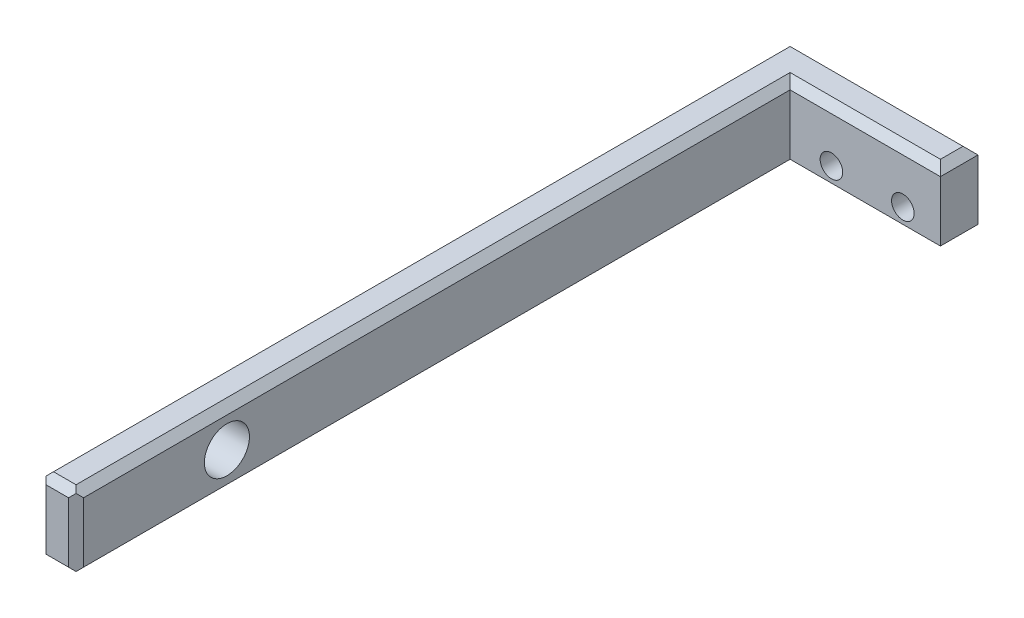
ISO-10303-21;
HEADER;
FILE_DESCRIPTION(('STEP AP214'),'2;1');
FILE_NAME('part.step','',(''),(''),'','','');
FILE_SCHEMA(('AUTOMOTIVE_DESIGN { 1 0 10303 214 1 1 1 1 }'));
ENDSEC;
DATA;
#1=APPLICATION_CONTEXT('core data for automotive mechanical design processes');
#2=APPLICATION_PROTOCOL_DEFINITION('international standard','automotive_design',2000,#1);
#3=PRODUCT_CONTEXT('',#1,'mechanical');
#4=PRODUCT('Part','Part','',(#3));
#5=PRODUCT_RELATED_PRODUCT_CATEGORY('part','',(#4));
#6=PRODUCT_DEFINITION_FORMATION('','',#4);
#7=PRODUCT_DEFINITION_CONTEXT('part definition',#1,'design');
#8=PRODUCT_DEFINITION('design','',#6,#7);
#9=PRODUCT_DEFINITION_SHAPE('','',#8);
#10=(LENGTH_UNIT() NAMED_UNIT(*) SI_UNIT(.MILLI.,.METRE.));
#11=(NAMED_UNIT(*) PLANE_ANGLE_UNIT() SI_UNIT($,.RADIAN.));
#12=(NAMED_UNIT(*) SI_UNIT($,.STERADIAN.) SOLID_ANGLE_UNIT());
#13=UNCERTAINTY_MEASURE_WITH_UNIT(LENGTH_MEASURE(1.E-05),#10,'distance_accuracy_value','');
#14=(GEOMETRIC_REPRESENTATION_CONTEXT(3) GLOBAL_UNCERTAINTY_ASSIGNED_CONTEXT((#13)) GLOBAL_UNIT_ASSIGNED_CONTEXT((#10,
#11,#12)) REPRESENTATION_CONTEXT('',''));
#15=CARTESIAN_POINT('',(0.,0.,0.));
#16=DIRECTION('',(0.,0.,1.));
#17=DIRECTION('',(1.,0.,0.));
#18=AXIS2_PLACEMENT_3D('',#15,#16,#17);
#19=CARTESIAN_POINT('',(5.,10.,0.));
#20=DIRECTION('',(0.,0.,-1.));
#21=DIRECTION('',(-1.,0.,0.));
#22=AXIS2_PLACEMENT_3D('',#19,#20,#21);
#23=PLANE('',#22);
#24=DIRECTION('',(-1.,0.,0.));
#25=VECTOR('',#24,1.);
#26=CARTESIAN_POINT('',(5.,9.,0.));
#27=LINE('',#26,#25);
#28=CARTESIAN_POINT('',(4.,9.,0.));
#29=VERTEX_POINT('',#28);
#30=CARTESIAN_POINT('',(1.,9.,0.));
#31=VERTEX_POINT('',#30);
#32=EDGE_CURVE('E210',#29,#31,#27,.T.);
#33=ORIENTED_EDGE('',*,*,#32,.T.);
#34=DIRECTION('',(0.,-1.,0.));
#35=VECTOR('',#34,1.);
#36=CARTESIAN_POINT('',(1.,10.,0.));
#37=LINE('',#36,#35);
#38=CARTESIAN_POINT('',(1.,1.,0.));
#39=VERTEX_POINT('',#38);
#40=EDGE_CURVE('E285',#31,#39,#37,.T.);
#41=ORIENTED_EDGE('',*,*,#40,.T.);
#42=DIRECTION('',(1.,0.,0.));
#43=VECTOR('',#42,1.);
#44=CARTESIAN_POINT('',(5.,1.,0.));
#45=LINE('',#44,#43);
#46=CARTESIAN_POINT('',(4.,1.,0.));
#47=VERTEX_POINT('',#46);
#48=EDGE_CURVE('E252',#39,#47,#45,.T.);
#49=ORIENTED_EDGE('',*,*,#48,.T.);
#50=DIRECTION('',(0.,1.,0.));
#51=VECTOR('',#50,1.);
#52=CARTESIAN_POINT('',(4.,10.,0.));
#53=LINE('',#52,#51);
#54=EDGE_CURVE('E283',#47,#29,#53,.T.);
#55=ORIENTED_EDGE('',*,*,#54,.T.);
#56=EDGE_LOOP('',(#33,#41,#49,#55));
#57=FACE_BOUND('',#56,.T.);
#58=ADVANCED_FACE('F43',(#57),#23,.F.);
#59=CARTESIAN_POINT('',(4.99999999999999,10.,-95.));
#60=DIRECTION('',(-1.,0.,0.));
#61=DIRECTION('',(0.,0.,1.));
#62=AXIS2_PLACEMENT_3D('',#59,#60,#61);
#63=PLANE('',#62);
#64=CARTESIAN_POINT('',(5.,5.,-20.0694910847058));
#65=DIRECTION('',(-1.,0.,0.));
#66=DIRECTION('',(0.,0.,1.));
#67=AXIS2_PLACEMENT_3D('',#64,#65,#66);
#68=CIRCLE('',#67,2.99999999999999);
#69=CARTESIAN_POINT('',(5.,5.,-17.0694910847058));
#70=VERTEX_POINT('',#69);
#71=EDGE_CURVE('E380',#70,#70,#68,.F.);
#72=ORIENTED_EDGE('',*,*,#71,.F.);
#73=EDGE_LOOP('',(#72));
#74=FACE_BOUND('',#73,.T.);
#75=DIRECTION('',(0.,0.,1.));
#76=VECTOR('',#75,1.);
#77=CARTESIAN_POINT('',(4.99999999999999,9.,-95.));
#78=LINE('',#77,#76);
#79=CARTESIAN_POINT('',(4.99999999999999,9.,-95.));
#80=VERTEX_POINT('',#79);
#81=CARTESIAN_POINT('',(5.,9.,-1.));
#82=VERTEX_POINT('',#81);
#83=EDGE_CURVE('E208',#80,#82,#78,.T.);
#84=ORIENTED_EDGE('',*,*,#83,.T.);
#85=DIRECTION('',(0.,-1.,0.));
#86=VECTOR('',#85,1.);
#87=CARTESIAN_POINT('',(5.,10.,-1.));
#88=LINE('',#87,#86);
#89=CARTESIAN_POINT('',(5.,1.,-1.));
#90=VERTEX_POINT('',#89);
#91=EDGE_CURVE('E301',#82,#90,#88,.T.);
#92=ORIENTED_EDGE('',*,*,#91,.T.);
#93=DIRECTION('',(0.,0.,-1.));
#94=VECTOR('',#93,1.);
#95=CARTESIAN_POINT('',(4.99999999999999,1.,-95.));
#96=LINE('',#95,#94);
#97=CARTESIAN_POINT('',(4.99999999999999,1.,-95.));
#98=VERTEX_POINT('',#97);
#99=EDGE_CURVE('E212',#90,#98,#96,.T.);
#100=ORIENTED_EDGE('',*,*,#99,.T.);
#101=DIRECTION('',(0.,-1.,0.));
#102=VECTOR('',#101,1.);
#103=CARTESIAN_POINT('',(4.99999999999999,10.,-95.));
#104=LINE('',#103,#102);
#105=EDGE_CURVE('E189',#80,#98,#104,.T.);
#106=ORIENTED_EDGE('',*,*,#105,.F.);
#107=EDGE_LOOP('',(#84,#92,#100,#106));
#108=FACE_BOUND('',#107,.T.);
#109=ADVANCED_FACE('F374',(#74,#108),#63,.F.);
#110=CARTESIAN_POINT('',(25.,10.,-95.));
#111=DIRECTION('',(0.,0.,-1.));
#112=DIRECTION('',(-1.,0.,0.));
#113=AXIS2_PLACEMENT_3D('',#110,#111,#112);
#114=PLANE('',#113);
#115=CARTESIAN_POINT('',(20.,3.,-95.));
#116=DIRECTION('',(0.,0.,-1.));
#117=DIRECTION('',(-1.,0.,0.));
#118=AXIS2_PLACEMENT_3D('',#115,#116,#117);
#119=CIRCLE('',#118,1.5);
#120=CARTESIAN_POINT('',(18.5,3.,-95.));
#121=VERTEX_POINT('',#120);
#122=EDGE_CURVE('E386',#121,#121,#119,.T.);
#123=ORIENTED_EDGE('',*,*,#122,.T.);
#124=EDGE_LOOP('',(#123));
#125=FACE_BOUND('',#124,.T.);
#126=CARTESIAN_POINT('',(10.5,3.,-95.));
#127=DIRECTION('',(0.,0.,-1.));
#128=DIRECTION('',(-1.,0.,0.));
#129=AXIS2_PLACEMENT_3D('',#126,#127,#128);
#130=CIRCLE('',#129,1.5);
#131=CARTESIAN_POINT('',(9.,3.,-95.));
#132=VERTEX_POINT('',#131);
#133=EDGE_CURVE('E389',#132,#132,#130,.T.);
#134=ORIENTED_EDGE('',*,*,#133,.T.);
#135=EDGE_LOOP('',(#134));
#136=FACE_BOUND('',#135,.T.);
#137=ORIENTED_EDGE('',*,*,#105,.T.);
#138=DIRECTION('',(1.,0.,0.));
#139=VECTOR('',#138,1.);
#140=CARTESIAN_POINT('',(25.,1.,-95.));
#141=LINE('',#140,#139);
#142=CARTESIAN_POINT('',(25.,1.,-95.));
#143=VERTEX_POINT('',#142);
#144=EDGE_CURVE('E242',#98,#143,#141,.T.);
#145=ORIENTED_EDGE('',*,*,#144,.T.);
#146=DIRECTION('',(0.,-1.,0.));
#147=VECTOR('',#146,1.);
#148=CARTESIAN_POINT('',(25.,10.,-95.));
#149=LINE('',#148,#147);
#150=CARTESIAN_POINT('',(25.,9.,-95.));
#151=VERTEX_POINT('',#150);
#152=EDGE_CURVE('E357',#151,#143,#149,.T.);
#153=ORIENTED_EDGE('',*,*,#152,.F.);
#154=DIRECTION('',(-1.,0.,0.));
#155=VECTOR('',#154,1.);
#156=CARTESIAN_POINT('',(25.,9.,-95.));
#157=LINE('',#156,#155);
#158=EDGE_CURVE('E206',#151,#80,#157,.T.);
#159=ORIENTED_EDGE('',*,*,#158,.T.);
#160=EDGE_LOOP('',(#137,#145,#153,#159));
#161=FACE_BOUND('',#160,.T.);
#162=ADVANCED_FACE('F363',(#125,#136,#161),#114,.F.);
#163=CARTESIAN_POINT('',(25.,10.,-100.));
#164=DIRECTION('',(-1.,0.,0.));
#165=DIRECTION('',(0.,0.,1.));
#166=AXIS2_PLACEMENT_3D('',#163,#164,#165);
#167=PLANE('',#166);
#168=ORIENTED_EDGE('',*,*,#152,.T.);
#169=DIRECTION('',(0.,0.,-1.));
#170=VECTOR('',#169,1.);
#171=CARTESIAN_POINT('',(25.,1.,-100.));
#172=LINE('',#171,#170);
#173=CARTESIAN_POINT('',(25.,1.,-100.));
#174=VERTEX_POINT('',#173);
#175=EDGE_CURVE('E244',#143,#174,#172,.T.);
#176=ORIENTED_EDGE('',*,*,#175,.T.);
#177=DIRECTION('',(0.,-1.,0.));
#178=VECTOR('',#177,1.);
#179=CARTESIAN_POINT('',(25.,10.,-100.));
#180=LINE('',#179,#178);
#181=CARTESIAN_POINT('',(25.,9.,-100.));
#182=VERTEX_POINT('',#181);
#183=EDGE_CURVE('E359',#182,#174,#180,.T.);
#184=ORIENTED_EDGE('',*,*,#183,.F.);
#185=DIRECTION('',(0.,0.,1.));
#186=VECTOR('',#185,1.);
#187=CARTESIAN_POINT('',(25.,9.,-100.));
#188=LINE('',#187,#186);
#189=EDGE_CURVE('E204',#182,#151,#188,.T.);
#190=ORIENTED_EDGE('',*,*,#189,.T.);
#191=EDGE_LOOP('',(#168,#176,#184,#190));
#192=FACE_BOUND('',#191,.T.);
#193=ADVANCED_FACE('F356',(#192),#167,.F.);
#194=CARTESIAN_POINT('',(0.,10.,-100.));
#195=DIRECTION('',(0.,0.,1.));
#196=DIRECTION('',(1.,0.,0.));
#197=AXIS2_PLACEMENT_3D('',#194,#195,#196);
#198=PLANE('',#197);
#199=CARTESIAN_POINT('',(20.,3.,-100.));
#200=DIRECTION('',(0.,0.,-1.));
#201=DIRECTION('',(-1.,0.,0.));
#202=AXIS2_PLACEMENT_3D('',#199,#200,#201);
#203=CIRCLE('',#202,1.5);
#204=CARTESIAN_POINT('',(18.5,3.,-100.));
#205=VERTEX_POINT('',#204);
#206=EDGE_CURVE('E392',#205,#205,#203,.T.);
#207=ORIENTED_EDGE('',*,*,#206,.F.);
#208=EDGE_LOOP('',(#207));
#209=FACE_BOUND('',#208,.T.);
#210=CARTESIAN_POINT('',(10.5,3.,-100.));
#211=DIRECTION('',(0.,0.,-1.));
#212=DIRECTION('',(-1.,0.,0.));
#213=AXIS2_PLACEMENT_3D('',#210,#211,#212);
#214=CIRCLE('',#213,1.5);
#215=CARTESIAN_POINT('',(9.,3.,-100.));
#216=VERTEX_POINT('',#215);
#217=EDGE_CURVE('E225',#216,#216,#214,.T.);
#218=ORIENTED_EDGE('',*,*,#217,.F.);
#219=EDGE_LOOP('',(#218));
#220=FACE_BOUND('',#219,.T.);
#221=DIRECTION('',(-1.,0.,0.));
#222=VECTOR('',#221,1.);
#223=CARTESIAN_POINT('',(0.,1.,-100.));
#224=LINE('',#223,#222);
#225=CARTESIAN_POINT('',(1.00000000000001,1.,-100.));
#226=VERTEX_POINT('',#225);
#227=EDGE_CURVE('E246',#174,#226,#224,.T.);
#228=ORIENTED_EDGE('',*,*,#227,.T.);
#229=DIRECTION('',(0.,1.,0.));
#230=VECTOR('',#229,1.);
#231=CARTESIAN_POINT('',(1.00000000000001,10.,-100.));
#232=LINE('',#231,#230);
#233=CARTESIAN_POINT('',(1.00000000000001,9.,-100.));
#234=VERTEX_POINT('',#233);
#235=EDGE_CURVE('E276',#226,#234,#232,.T.);
#236=ORIENTED_EDGE('',*,*,#235,.T.);
#237=DIRECTION('',(1.,0.,0.));
#238=VECTOR('',#237,1.);
#239=CARTESIAN_POINT('',(0.,9.,-100.));
#240=LINE('',#239,#238);
#241=EDGE_CURVE('E197',#234,#182,#240,.T.);
#242=ORIENTED_EDGE('',*,*,#241,.T.);
#243=ORIENTED_EDGE('',*,*,#183,.T.);
#244=EDGE_LOOP('',(#228,#236,#242,#243));
#245=FACE_BOUND('',#244,.T.);
#246=ADVANCED_FACE('F342',(#209,#220,#245),#198,.F.);
#247=CARTESIAN_POINT('',(0.,10.,0.));
#248=DIRECTION('',(1.,0.,0.));
#249=DIRECTION('',(0.,0.,-1.));
#250=AXIS2_PLACEMENT_3D('',#247,#248,#249);
#251=PLANE('',#250);
#252=CARTESIAN_POINT('',(0.,5.,-20.0694910847058));
#253=DIRECTION('',(1.,0.,0.));
#254=DIRECTION('',(0.,0.,-1.));
#255=AXIS2_PLACEMENT_3D('',#252,#253,#254);
#256=CIRCLE('',#255,2.99999999999999);
#257=CARTESIAN_POINT('',(0.,5.,-23.0694910847058));
#258=VERTEX_POINT('',#257);
#259=EDGE_CURVE('E383',#258,#258,#256,.T.);
#260=ORIENTED_EDGE('',*,*,#259,.T.);
#261=EDGE_LOOP('',(#260));
#262=FACE_BOUND('',#261,.T.);
#263=DIRECTION('',(0.,0.,1.));
#264=VECTOR('',#263,1.);
#265=CARTESIAN_POINT('',(0.,1.,0.));
#266=LINE('',#265,#264);
#267=CARTESIAN_POINT('',(0.,1.,-99.));
#268=VERTEX_POINT('',#267);
#269=CARTESIAN_POINT('',(0.,1.,-1.));
#270=VERTEX_POINT('',#269);
#271=EDGE_CURVE('E249',#268,#270,#266,.T.);
#272=ORIENTED_EDGE('',*,*,#271,.T.);
#273=DIRECTION('',(0.,1.,0.));
#274=VECTOR('',#273,1.);
#275=CARTESIAN_POINT('',(0.,10.,-1.));
#276=LINE('',#275,#274);
#277=CARTESIAN_POINT('',(0.,9.,-1.));
#278=VERTEX_POINT('',#277);
#279=EDGE_CURVE('E294',#270,#278,#276,.T.);
#280=ORIENTED_EDGE('',*,*,#279,.T.);
#281=DIRECTION('',(0.,0.,-1.));
#282=VECTOR('',#281,1.);
#283=CARTESIAN_POINT('',(0.,9.,0.));
#284=LINE('',#283,#282);
#285=CARTESIAN_POINT('',(0.,9.,-99.));
#286=VERTEX_POINT('',#285);
#287=EDGE_CURVE('E195',#278,#286,#284,.T.);
#288=ORIENTED_EDGE('',*,*,#287,.T.);
#289=DIRECTION('',(0.,-1.,0.));
#290=VECTOR('',#289,1.);
#291=CARTESIAN_POINT('',(0.,10.,-99.));
#292=LINE('',#291,#290);
#293=EDGE_CURVE('E255',#286,#268,#292,.T.);
#294=ORIENTED_EDGE('',*,*,#293,.T.);
#295=EDGE_LOOP('',(#272,#280,#288,#294));
#296=FACE_BOUND('',#295,.T.);
#297=ADVANCED_FACE('F326',(#262,#296),#251,.F.);
#298=CARTESIAN_POINT('',(0.,10.,0.));
#299=DIRECTION('',(0.,-1.,0.));
#300=DIRECTION('',(0.,0.,-1.));
#301=AXIS2_PLACEMENT_3D('',#298,#299,#300);
#302=PLANE('',#301);
#303=DIRECTION('',(-1.,0.,0.));
#304=VECTOR('',#303,1.);
#305=CARTESIAN_POINT('',(0.,10.,-99.));
#306=LINE('',#305,#304);
#307=CARTESIAN_POINT('',(24.,10.,-99.));
#308=VERTEX_POINT('',#307);
#309=CARTESIAN_POINT('',(1.,10.,-99.));
#310=VERTEX_POINT('',#309);
#311=EDGE_CURVE('E193',#308,#310,#306,.T.);
#312=ORIENTED_EDGE('',*,*,#311,.T.);
#313=DIRECTION('',(0.,0.,1.));
#314=VECTOR('',#313,1.);
#315=CARTESIAN_POINT('',(1.,10.,0.));
#316=LINE('',#315,#314);
#317=CARTESIAN_POINT('',(1.,10.,-1.));
#318=VERTEX_POINT('',#317);
#319=EDGE_CURVE('E174',#310,#318,#316,.T.);
#320=ORIENTED_EDGE('',*,*,#319,.T.);
#321=DIRECTION('',(1.,0.,0.));
#322=VECTOR('',#321,1.);
#323=CARTESIAN_POINT('',(0.,10.,-1.));
#324=LINE('',#323,#322);
#325=CARTESIAN_POINT('',(4.,10.,-1.));
#326=VERTEX_POINT('',#325);
#327=EDGE_CURVE('E183',#318,#326,#324,.T.);
#328=ORIENTED_EDGE('',*,*,#327,.T.);
#329=DIRECTION('',(0.,0.,-1.));
#330=VECTOR('',#329,1.);
#331=CARTESIAN_POINT('',(4.,10.,0.));
#332=LINE('',#331,#330);
#333=CARTESIAN_POINT('',(3.99999999999999,10.,-96.));
#334=VERTEX_POINT('',#333);
#335=EDGE_CURVE('E188',#326,#334,#332,.T.);
#336=ORIENTED_EDGE('',*,*,#335,.T.);
#337=DIRECTION('',(1.,0.,0.));
#338=VECTOR('',#337,1.);
#339=CARTESIAN_POINT('',(0.,10.,-96.));
#340=LINE('',#339,#338);
#341=CARTESIAN_POINT('',(24.,10.,-96.));
#342=VERTEX_POINT('',#341);
#343=EDGE_CURVE('E371',#334,#342,#340,.T.);
#344=ORIENTED_EDGE('',*,*,#343,.T.);
#345=DIRECTION('',(0.,0.,-1.));
#346=VECTOR('',#345,1.);
#347=CARTESIAN_POINT('',(24.,10.,0.));
#348=LINE('',#347,#346);
#349=EDGE_CURVE('E199',#342,#308,#348,.T.);
#350=ORIENTED_EDGE('',*,*,#349,.T.);
#351=EDGE_LOOP('',(#312,#320,#328,#336,#344,#350));
#352=FACE_BOUND('',#351,.T.);
#353=ADVANCED_FACE('F191',(#352),#302,.F.);
#354=CARTESIAN_POINT('',(0.,0.,0.));
#355=DIRECTION('',(0.,-1.,0.));
#356=DIRECTION('',(0.,0.,-1.));
#357=AXIS2_PLACEMENT_3D('',#354,#355,#356);
#358=PLANE('',#357);
#359=DIRECTION('',(-1.,0.,0.));
#360=VECTOR('',#359,1.);
#361=CARTESIAN_POINT('',(4.99999999999999,0.,-96.));
#362=LINE('',#361,#360);
#363=CARTESIAN_POINT('',(24.,0.,-96.));
#364=VERTEX_POINT('',#363);
#365=CARTESIAN_POINT('',(3.99999999999999,0.,-96.));
#366=VERTEX_POINT('',#365);
#367=EDGE_CURVE('E237',#364,#366,#362,.T.);
#368=ORIENTED_EDGE('',*,*,#367,.T.);
#369=DIRECTION('',(0.,0.,1.));
#370=VECTOR('',#369,1.);
#371=CARTESIAN_POINT('',(4.,0.,0.));
#372=LINE('',#371,#370);
#373=CARTESIAN_POINT('',(4.,0.,-1.));
#374=VERTEX_POINT('',#373);
#375=EDGE_CURVE('E239',#366,#374,#372,.T.);
#376=ORIENTED_EDGE('',*,*,#375,.T.);
#377=DIRECTION('',(-1.,0.,0.));
#378=VECTOR('',#377,1.);
#379=CARTESIAN_POINT('',(0.,0.,-1.));
#380=LINE('',#379,#378);
#381=CARTESIAN_POINT('',(1.,0.,-1.));
#382=VERTEX_POINT('',#381);
#383=EDGE_CURVE('E227',#374,#382,#380,.T.);
#384=ORIENTED_EDGE('',*,*,#383,.T.);
#385=DIRECTION('',(0.,0.,-1.));
#386=VECTOR('',#385,1.);
#387=CARTESIAN_POINT('',(1.,0.,-100.));
#388=LINE('',#387,#386);
#389=CARTESIAN_POINT('',(1.,0.,-99.));
#390=VERTEX_POINT('',#389);
#391=EDGE_CURVE('E230',#382,#390,#388,.T.);
#392=ORIENTED_EDGE('',*,*,#391,.T.);
#393=DIRECTION('',(1.,0.,0.));
#394=VECTOR('',#393,1.);
#395=CARTESIAN_POINT('',(25.,0.,-99.));
#396=LINE('',#395,#394);
#397=CARTESIAN_POINT('',(24.,0.,-99.));
#398=VERTEX_POINT('',#397);
#399=EDGE_CURVE('E233',#390,#398,#396,.T.);
#400=ORIENTED_EDGE('',*,*,#399,.T.);
#401=DIRECTION('',(0.,0.,1.));
#402=VECTOR('',#401,1.);
#403=CARTESIAN_POINT('',(24.,0.,-95.));
#404=LINE('',#403,#402);
#405=EDGE_CURVE('E235',#398,#364,#404,.T.);
#406=ORIENTED_EDGE('',*,*,#405,.T.);
#407=EDGE_LOOP('',(#368,#376,#384,#392,#400,#406));
#408=FACE_BOUND('',#407,.T.);
#409=ADVANCED_FACE('F568',(#408),#358,.T.);
#410=CARTESIAN_POINT('',(10.,5.,-20.0694910847058));
#411=DIRECTION('',(-1.,0.,0.));
#412=DIRECTION('',(0.,0.,1.));
#413=AXIS2_PLACEMENT_3D('',#410,#411,#412);
#414=CYLINDRICAL_SURFACE('',#413,2.99999999999999);
#415=ORIENTED_EDGE('',*,*,#259,.F.);
#416=EDGE_LOOP('',(#415));
#417=FACE_BOUND('',#416,.T.);
#418=ORIENTED_EDGE('',*,*,#71,.T.);
#419=EDGE_LOOP('',(#418));
#420=FACE_BOUND('',#419,.T.);
#421=ADVANCED_FACE('F409',(#417,#420),#414,.F.);
#422=CARTESIAN_POINT('',(10.5,3.,-80.));
#423=DIRECTION('',(0.,0.,-1.));
#424=DIRECTION('',(-1.,0.,0.));
#425=AXIS2_PLACEMENT_3D('',#422,#423,#424);
#426=CYLINDRICAL_SURFACE('',#425,1.5);
#427=ORIENTED_EDGE('',*,*,#217,.T.);
#428=EDGE_LOOP('',(#427));
#429=FACE_BOUND('',#428,.T.);
#430=ORIENTED_EDGE('',*,*,#133,.F.);
#431=EDGE_LOOP('',(#430));
#432=FACE_BOUND('',#431,.T.);
#433=ADVANCED_FACE('F406',(#429,#432),#426,.F.);
#434=CARTESIAN_POINT('',(20.,3.,-80.));
#435=DIRECTION('',(0.,0.,-1.));
#436=DIRECTION('',(-1.,0.,0.));
#437=AXIS2_PLACEMENT_3D('',#434,#435,#436);
#438=CYLINDRICAL_SURFACE('',#437,1.5);
#439=ORIENTED_EDGE('',*,*,#206,.T.);
#440=EDGE_LOOP('',(#439));
#441=FACE_BOUND('',#440,.T.);
#442=ORIENTED_EDGE('',*,*,#122,.F.);
#443=EDGE_LOOP('',(#442));
#444=FACE_BOUND('',#443,.T.);
#445=ADVANCED_FACE('F398',(#441,#444),#438,.F.);
#446=CARTESIAN_POINT('',(0.,10.,-96.));
#447=DIRECTION('',(0.,-0.707106781186547,-0.707106781186547));
#448=DIRECTION('',(1.,0.,0.));
#449=AXIS2_PLACEMENT_3D('',#446,#447,#448);
#450=PLANE('',#449);
#451=DIRECTION('',(-0.577350269189626,0.577350269189626,-0.577350269189626));
#452=VECTOR('',#451,1.);
#453=CARTESIAN_POINT('',(2.66666666666666,11.3333333333333,-97.3333333333333));
#454=LINE('',#453,#452);
#455=EDGE_CURVE('E219',#80,#334,#454,.T.);
#456=ORIENTED_EDGE('',*,*,#455,.F.);
#457=ORIENTED_EDGE('',*,*,#158,.F.);
#458=DIRECTION('',(-0.577350269189626,0.577350269189626,-0.577350269189626));
#459=VECTOR('',#458,1.);
#460=CARTESIAN_POINT('',(16.,18.,-104.));
#461=LINE('',#460,#459);
#462=EDGE_CURVE('E222',#342,#151,#461,.F.);
#463=ORIENTED_EDGE('',*,*,#462,.F.);
#464=ORIENTED_EDGE('',*,*,#343,.F.);
#465=EDGE_LOOP('',(#456,#457,#463,#464));
#466=FACE_BOUND('',#465,.T.);
#467=ADVANCED_FACE('F369',(#466),#450,.F.);
#468=CARTESIAN_POINT('',(24.,10.,0.));
#469=DIRECTION('',(-0.707106781186547,-0.707106781186547,0.));
#470=DIRECTION('',(0.,0.,-1.));
#471=AXIS2_PLACEMENT_3D('',#468,#469,#470);
#472=PLANE('',#471);
#473=ORIENTED_EDGE('',*,*,#462,.T.);
#474=ORIENTED_EDGE('',*,*,#189,.F.);
#475=DIRECTION('',(-0.577350269189626,0.577350269189626,0.577350269189626));
#476=VECTOR('',#475,1.);
#477=CARTESIAN_POINT('',(-9.00000000000001,43.,-66.));
#478=LINE('',#477,#476);
#479=EDGE_CURVE('E216',#308,#182,#478,.F.);
#480=ORIENTED_EDGE('',*,*,#479,.F.);
#481=ORIENTED_EDGE('',*,*,#349,.F.);
#482=EDGE_LOOP('',(#473,#474,#480,#481));
#483=FACE_BOUND('',#482,.T.);
#484=ADVANCED_FACE('F351',(#483),#472,.F.);
#485=CARTESIAN_POINT('',(4.,10.,0.));
#486=DIRECTION('',(-0.707106781186547,-0.707106781186547,0.));
#487=DIRECTION('',(0.,0.,-1.));
#488=AXIS2_PLACEMENT_3D('',#485,#486,#487);
#489=PLANE('',#488);
#490=DIRECTION('',(-0.577350269189626,0.577350269189626,-0.577350269189626));
#491=VECTOR('',#490,1.);
#492=CARTESIAN_POINT('',(2.66666666666667,11.3333333333333,-2.33333333333333));
#493=LINE('',#492,#491);
#494=CARTESIAN_POINT('',(4.5,9.5,-0.500000000000001));
#495=VERTEX_POINT('',#494);
#496=EDGE_CURVE('E185',#495,#326,#493,.T.);
#497=ORIENTED_EDGE('',*,*,#496,.F.);
#498=DIRECTION('',(0.577350269189626,-0.577350269189626,-0.577350269189626));
#499=VECTOR('',#498,1.);
#500=CARTESIAN_POINT('',(4.,10.,0.));
#501=LINE('',#500,#499);
#502=EDGE_CURVE('E11',#495,#82,#501,.T.);
#503=ORIENTED_EDGE('',*,*,#502,.T.);
#504=ORIENTED_EDGE('',*,*,#83,.F.);
#505=ORIENTED_EDGE('',*,*,#455,.T.);
#506=ORIENTED_EDGE('',*,*,#335,.F.);
#507=EDGE_LOOP('',(#497,#503,#504,#505,#506));
#508=FACE_BOUND('',#507,.T.);
#509=ADVANCED_FACE('F372',(#508),#489,.F.);
#510=CARTESIAN_POINT('',(0.,10.,-99.));
#511=DIRECTION('',(0.,-0.707106781186547,0.707106781186547));
#512=DIRECTION('',(-1.,0.,0.));
#513=AXIS2_PLACEMENT_3D('',#510,#511,#512);
#514=PLANE('',#513);
#515=ORIENTED_EDGE('',*,*,#241,.F.);
#516=DIRECTION('',(-0.57735026918962,0.577350269189628,0.577350269189628));
#517=VECTOR('',#516,1.);
#518=CARTESIAN_POINT('',(0.,10.,-99.));
#519=LINE('',#518,#517);
#520=CARTESIAN_POINT('',(0.500000000000015,9.50000000000002,-99.5));
#521=VERTEX_POINT('',#520);
#522=EDGE_CURVE('E278',#234,#521,#519,.T.);
#523=ORIENTED_EDGE('',*,*,#522,.T.);
#524=DIRECTION('',(0.577350269189626,0.577350269189626,0.577350269189626));
#525=VECTOR('',#524,1.);
#526=CARTESIAN_POINT('',(0.666666666666667,9.66666666666667,-99.3333333333333));
#527=LINE('',#526,#525);
#528=EDGE_CURVE('E179',#310,#521,#527,.F.);
#529=ORIENTED_EDGE('',*,*,#528,.F.);
#530=ORIENTED_EDGE('',*,*,#311,.F.);
#531=ORIENTED_EDGE('',*,*,#479,.T.);
#532=EDGE_LOOP('',(#515,#523,#529,#530,#531));
#533=FACE_BOUND('',#532,.T.);
#534=ADVANCED_FACE('F346',(#533),#514,.F.);
#535=CARTESIAN_POINT('',(0.,10.,-1.));
#536=DIRECTION('',(0.,-0.707106781186547,-0.707106781186547));
#537=DIRECTION('',(1.,0.,0.));
#538=AXIS2_PLACEMENT_3D('',#535,#536,#537);
#539=PLANE('',#538);
#540=DIRECTION('',(-0.577350269189626,-0.577350269189626,0.577350269189626));
#541=VECTOR('',#540,1.);
#542=CARTESIAN_POINT('',(0.666666666666667,9.66666666666667,-0.666666666666667));
#543=LINE('',#542,#541);
#544=CARTESIAN_POINT('',(0.5,9.5,-0.5));
#545=VERTEX_POINT('',#544);
#546=EDGE_CURVE('E168',#545,#318,#543,.F.);
#547=ORIENTED_EDGE('',*,*,#546,.F.);
#548=DIRECTION('',(0.577350269189626,-0.577350269189626,0.577350269189626));
#549=VECTOR('',#548,1.);
#550=CARTESIAN_POINT('',(0.,10.,-1.));
#551=LINE('',#550,#549);
#552=EDGE_CURVE('E299',#545,#31,#551,.T.);
#553=ORIENTED_EDGE('',*,*,#552,.T.);
#554=ORIENTED_EDGE('',*,*,#32,.F.);
#555=DIRECTION('',(0.577350269189626,0.577350269189626,-0.577350269189626));
#556=VECTOR('',#555,1.);
#557=CARTESIAN_POINT('',(3.33333333333333,8.33333333333333,0.666666666666666));
#558=LINE('',#557,#556);
#559=EDGE_CURVE('E297',#29,#495,#558,.T.);
#560=ORIENTED_EDGE('',*,*,#559,.T.);
#561=ORIENTED_EDGE('',*,*,#496,.T.);
#562=ORIENTED_EDGE('',*,*,#327,.F.);
#563=EDGE_LOOP('',(#547,#553,#554,#560,#561,#562));
#564=FACE_BOUND('',#563,.T.);
#565=ADVANCED_FACE('F184',(#564),#539,.F.);
#566=CARTESIAN_POINT('',(1.,10.,0.));
#567=DIRECTION('',(0.707106781186547,-0.707106781186547,0.));
#568=DIRECTION('',(0.,0.,1.));
#569=AXIS2_PLACEMENT_3D('',#566,#567,#568);
#570=PLANE('',#569);
#571=ORIENTED_EDGE('',*,*,#287,.F.);
#572=DIRECTION('',(0.577350269189626,0.577350269189626,0.577350269189626));
#573=VECTOR('',#572,1.);
#574=CARTESIAN_POINT('',(1.,10.,0.));
#575=LINE('',#574,#573);
#576=EDGE_CURVE('E176',#278,#545,#575,.T.);
#577=ORIENTED_EDGE('',*,*,#576,.T.);
#578=ORIENTED_EDGE('',*,*,#546,.T.);
#579=ORIENTED_EDGE('',*,*,#319,.F.);
#580=ORIENTED_EDGE('',*,*,#528,.T.);
#581=DIRECTION('',(-0.577350269189623,-0.577350269189623,0.577350269189631));
#582=VECTOR('',#581,1.);
#583=CARTESIAN_POINT('',(-32.3333333333335,-23.3333333333335,-66.666666666666));
#584=LINE('',#583,#582);
#585=EDGE_CURVE('E280',#521,#286,#584,.T.);
#586=ORIENTED_EDGE('',*,*,#585,.T.);
#587=EDGE_LOOP('',(#571,#577,#578,#579,#580,#586));
#588=FACE_BOUND('',#587,.T.);
#589=ADVANCED_FACE('F171',(#588),#570,.F.);
#590=CARTESIAN_POINT('',(0.,1.,-100.));
#591=DIRECTION('',(0.,-0.707106781186547,-0.707106781186547));
#592=DIRECTION('',(1.,0.,0.));
#593=AXIS2_PLACEMENT_3D('',#590,#591,#592);
#594=PLANE('',#593);
#595=DIRECTION('',(0.577350269189626,-0.577350269189626,0.577350269189626));
#596=VECTOR('',#595,1.);
#597=CARTESIAN_POINT('',(33.3333333333333,-32.3333333333333,-66.6666666666667));
#598=LINE('',#597,#596);
#599=CARTESIAN_POINT('',(0.500000000000014,0.499999999999987,-99.5));
#600=VERTEX_POINT('',#599);
#601=EDGE_CURVE('E180',#600,#390,#598,.T.);
#602=ORIENTED_EDGE('',*,*,#601,.F.);
#603=DIRECTION('',(-0.57735026918962,-0.577350269189628,0.577350269189628));
#604=VECTOR('',#603,1.);
#605=CARTESIAN_POINT('',(0.666666666666683,0.666666666666664,-99.6666666666667));
#606=LINE('',#605,#604);
#607=EDGE_CURVE('E274',#600,#226,#606,.F.);
#608=ORIENTED_EDGE('',*,*,#607,.T.);
#609=ORIENTED_EDGE('',*,*,#227,.F.);
#610=DIRECTION('',(-0.577350269189626,-0.577350269189626,0.577350269189626));
#611=VECTOR('',#610,1.);
#612=CARTESIAN_POINT('',(16.6666666666667,-7.33333333333333,-91.6666666666667));
#613=LINE('',#612,#611);
#614=EDGE_CURVE('E266',#398,#174,#613,.F.);
#615=ORIENTED_EDGE('',*,*,#614,.F.);
#616=ORIENTED_EDGE('',*,*,#399,.F.);
#617=EDGE_LOOP('',(#602,#608,#609,#615,#616));
#618=FACE_BOUND('',#617,.T.);
#619=ADVANCED_FACE('F336',(#618),#594,.T.);
#620=CARTESIAN_POINT('',(0.,1.,0.));
#621=DIRECTION('',(-0.707106781186547,-0.707106781186547,0.));
#622=DIRECTION('',(0.,0.,-1.));
#623=AXIS2_PLACEMENT_3D('',#620,#621,#622);
#624=PLANE('',#623);
#625=DIRECTION('',(0.577350269189626,-0.577350269189626,-0.577350269189626));
#626=VECTOR('',#625,1.);
#627=CARTESIAN_POINT('',(1.66666666666667,-0.666666666666666,-1.66666666666667));
#628=LINE('',#627,#626);
#629=CARTESIAN_POINT('',(0.500000000000001,0.5,-0.5));
#630=VERTEX_POINT('',#629);
#631=EDGE_CURVE('E264',#630,#382,#628,.T.);
#632=ORIENTED_EDGE('',*,*,#631,.F.);
#633=DIRECTION('',(0.577350269189626,-0.577350269189626,0.577350269189626));
#634=VECTOR('',#633,1.);
#635=CARTESIAN_POINT('',(0.333333333333334,0.666666666666667,-0.666666666666667));
#636=LINE('',#635,#634);
#637=EDGE_CURVE('E292',#630,#270,#636,.F.);
#638=ORIENTED_EDGE('',*,*,#637,.T.);
#639=ORIENTED_EDGE('',*,*,#271,.F.);
#640=DIRECTION('',(-0.577350269189623,0.577350269189623,0.577350269189631));
#641=VECTOR('',#640,1.);
#642=CARTESIAN_POINT('',(-33.0000000000001,34.0000000000001,-65.9999999999994));
#643=LINE('',#642,#641);
#644=EDGE_CURVE('E272',#268,#600,#643,.F.);
#645=ORIENTED_EDGE('',*,*,#644,.T.);
#646=ORIENTED_EDGE('',*,*,#601,.T.);
#647=ORIENTED_EDGE('',*,*,#391,.F.);
#648=EDGE_LOOP('',(#632,#638,#639,#645,#646,#647));
#649=FACE_BOUND('',#648,.T.);
#650=ADVANCED_FACE('F323',(#649),#624,.T.);
#651=CARTESIAN_POINT('',(25.,1.,-100.));
#652=DIRECTION('',(0.707106781186547,-0.707106781186547,0.));
#653=DIRECTION('',(0.,0.,1.));
#654=AXIS2_PLACEMENT_3D('',#651,#652,#653);
#655=PLANE('',#654);
#656=ORIENTED_EDGE('',*,*,#614,.T.);
#657=ORIENTED_EDGE('',*,*,#175,.F.);
#658=DIRECTION('',(-0.577350269189626,-0.577350269189626,-0.577350269189626));
#659=VECTOR('',#658,1.);
#660=CARTESIAN_POINT('',(23.3333333333333,-0.666666666666667,-96.6666666666667));
#661=LINE('',#660,#659);
#662=EDGE_CURVE('E261',#364,#143,#661,.F.);
#663=ORIENTED_EDGE('',*,*,#662,.F.);
#664=ORIENTED_EDGE('',*,*,#405,.F.);
#665=EDGE_LOOP('',(#656,#657,#663,#664));
#666=FACE_BOUND('',#665,.T.);
#667=ADVANCED_FACE('F448',(#666),#655,.T.);
#668=CARTESIAN_POINT('',(5.,1.,0.));
#669=DIRECTION('',(0.,-0.707106781186547,0.707106781186547));
#670=DIRECTION('',(-1.,0.,0.));
#671=AXIS2_PLACEMENT_3D('',#668,#669,#670);
#672=PLANE('',#671);
#673=ORIENTED_EDGE('',*,*,#48,.F.);
#674=DIRECTION('',(0.577350269189626,0.577350269189626,0.577350269189626));
#675=VECTOR('',#674,1.);
#676=CARTESIAN_POINT('',(2.33333333333333,2.33333333333333,1.33333333333333));
#677=LINE('',#676,#675);
#678=EDGE_CURVE('E290',#39,#630,#677,.F.);
#679=ORIENTED_EDGE('',*,*,#678,.T.);
#680=ORIENTED_EDGE('',*,*,#631,.T.);
#681=ORIENTED_EDGE('',*,*,#383,.F.);
#682=DIRECTION('',(0.577350269189626,0.577350269189626,0.577350269189626));
#683=VECTOR('',#682,1.);
#684=CARTESIAN_POINT('',(5.,1.,0.));
#685=LINE('',#684,#683);
#686=CARTESIAN_POINT('',(4.5,0.500000000000001,-0.5));
#687=VERTEX_POINT('',#686);
#688=EDGE_CURVE('E259',#687,#374,#685,.F.);
#689=ORIENTED_EDGE('',*,*,#688,.F.);
#690=DIRECTION('',(0.577350269189626,-0.577350269189626,-0.577350269189626));
#691=VECTOR('',#690,1.);
#692=CARTESIAN_POINT('',(4.33333333333333,0.666666666666667,-0.333333333333334));
#693=LINE('',#692,#691);
#694=EDGE_CURVE('E288',#687,#47,#693,.F.);
#695=ORIENTED_EDGE('',*,*,#694,.T.);
#696=EDGE_LOOP('',(#673,#679,#680,#681,#689,#695));
#697=FACE_BOUND('',#696,.T.);
#698=ADVANCED_FACE('F310',(#697),#672,.T.);
#699=CARTESIAN_POINT('',(25.,1.,-95.));
#700=DIRECTION('',(0.,-0.707106781186547,0.707106781186547));
#701=DIRECTION('',(-1.,0.,0.));
#702=AXIS2_PLACEMENT_3D('',#699,#700,#701);
#703=PLANE('',#702);
#704=ORIENTED_EDGE('',*,*,#662,.T.);
#705=ORIENTED_EDGE('',*,*,#144,.F.);
#706=DIRECTION('',(-0.577350269189626,-0.577350269189626,-0.577350269189626));
#707=VECTOR('',#706,1.);
#708=CARTESIAN_POINT('',(4.99999999999999,1.,-95.));
#709=LINE('',#708,#707);
#710=EDGE_CURVE('E256',#366,#98,#709,.F.);
#711=ORIENTED_EDGE('',*,*,#710,.F.);
#712=ORIENTED_EDGE('',*,*,#367,.F.);
#713=EDGE_LOOP('',(#704,#705,#711,#712));
#714=FACE_BOUND('',#713,.T.);
#715=ADVANCED_FACE('F442',(#714),#703,.T.);
#716=CARTESIAN_POINT('',(4.99999999999999,1.,-95.));
#717=DIRECTION('',(0.707106781186547,-0.707106781186547,0.));
#718=DIRECTION('',(0.,0.,1.));
#719=AXIS2_PLACEMENT_3D('',#716,#717,#718);
#720=PLANE('',#719);
#721=ORIENTED_EDGE('',*,*,#99,.F.);
#722=DIRECTION('',(0.577350269189626,0.577350269189626,-0.577350269189626));
#723=VECTOR('',#722,1.);
#724=CARTESIAN_POINT('',(36.3333333333333,32.3333333333333,-32.3333333333333));
#725=LINE('',#724,#723);
#726=EDGE_CURVE('E51',#90,#687,#725,.F.);
#727=ORIENTED_EDGE('',*,*,#726,.T.);
#728=ORIENTED_EDGE('',*,*,#688,.T.);
#729=ORIENTED_EDGE('',*,*,#375,.F.);
#730=ORIENTED_EDGE('',*,*,#710,.T.);
#731=EDGE_LOOP('',(#721,#727,#728,#729,#730));
#732=FACE_BOUND('',#731,.T.);
#733=ADVANCED_FACE('F305',(#732),#720,.T.);
#734=CARTESIAN_POINT('',(0.,10.,-99.));
#735=DIRECTION('',(0.707106781186552,0.,0.707106781186543));
#736=DIRECTION('',(0.,-1.,0.));
#737=AXIS2_PLACEMENT_3D('',#734,#735,#736);
#738=PLANE('',#737);
#739=ORIENTED_EDGE('',*,*,#522,.F.);
#740=ORIENTED_EDGE('',*,*,#235,.F.);
#741=ORIENTED_EDGE('',*,*,#607,.F.);
#742=ORIENTED_EDGE('',*,*,#644,.F.);
#743=ORIENTED_EDGE('',*,*,#293,.F.);
#744=ORIENTED_EDGE('',*,*,#585,.F.);
#745=EDGE_LOOP('',(#739,#740,#741,#742,#743,#744));
#746=FACE_BOUND('',#745,.T.);
#747=ADVANCED_FACE('F331',(#746),#738,.F.);
#748=CARTESIAN_POINT('',(1.,10.,0.));
#749=DIRECTION('',(0.707106781186547,0.,-0.707106781186547));
#750=DIRECTION('',(0.,-1.,0.));
#751=AXIS2_PLACEMENT_3D('',#748,#749,#750);
#752=PLANE('',#751);
#753=ORIENTED_EDGE('',*,*,#576,.F.);
#754=ORIENTED_EDGE('',*,*,#279,.F.);
#755=ORIENTED_EDGE('',*,*,#637,.F.);
#756=ORIENTED_EDGE('',*,*,#678,.F.);
#757=ORIENTED_EDGE('',*,*,#40,.F.);
#758=ORIENTED_EDGE('',*,*,#552,.F.);
#759=EDGE_LOOP('',(#753,#754,#755,#756,#757,#758));
#760=FACE_BOUND('',#759,.T.);
#761=ADVANCED_FACE('F317',(#760),#752,.F.);
#762=CARTESIAN_POINT('',(5.,10.,-1.));
#763=DIRECTION('',(-0.707106781186547,0.,-0.707106781186547));
#764=DIRECTION('',(0.,-1.,0.));
#765=AXIS2_PLACEMENT_3D('',#762,#763,#764);
#766=PLANE('',#765);
#767=ORIENTED_EDGE('',*,*,#559,.F.);
#768=ORIENTED_EDGE('',*,*,#54,.F.);
#769=ORIENTED_EDGE('',*,*,#694,.F.);
#770=ORIENTED_EDGE('',*,*,#726,.F.);
#771=ORIENTED_EDGE('',*,*,#91,.F.);
#772=ORIENTED_EDGE('',*,*,#502,.F.);
#773=EDGE_LOOP('',(#767,#768,#769,#770,#771,#772));
#774=FACE_BOUND('',#773,.T.);
#775=ADVANCED_FACE('F45',(#774),#766,.F.);
#776=CLOSED_SHELL('',(#58,#109,#162,#193,#246,#297,#353,#409,#421,#433,#445,#467,#484,#509,#534,
#565,#589,#619,#650,#667,#698,#715,#733,#747,#761,#775));
#777=MANIFOLD_SOLID_BREP('B2',#776);
#778=ADVANCED_BREP_SHAPE_REPRESENTATION('',(#18,#777),#14);
#779=SHAPE_DEFINITION_REPRESENTATION(#9,#778);
ENDSEC;
END-ISO-10303-21;
